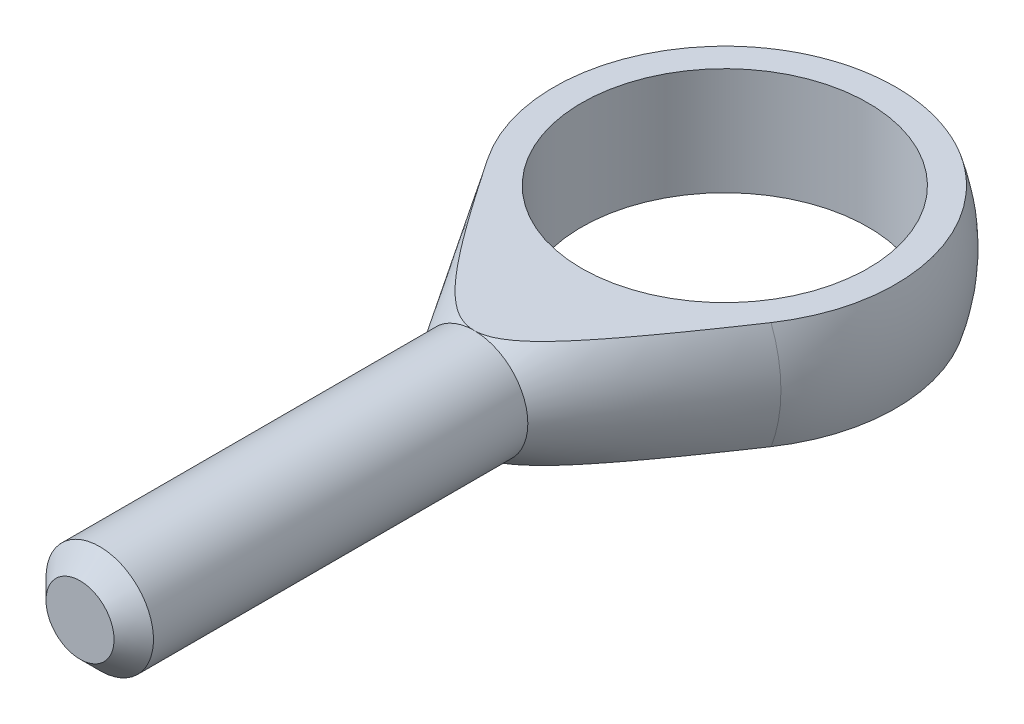
ISO-10303-21;
HEADER;
FILE_DESCRIPTION(('STEP AP214'),'2;1');
FILE_NAME('part.step','',(''),(''),'','','');
FILE_SCHEMA(('AUTOMOTIVE_DESIGN { 1 0 10303 214 1 1 1 1 }'));
ENDSEC;
DATA;
#1=APPLICATION_CONTEXT('core data for automotive mechanical design processes');
#2=APPLICATION_PROTOCOL_DEFINITION('international standard','automotive_design',2000,#1);
#3=PRODUCT_CONTEXT('',#1,'mechanical');
#4=PRODUCT('Part','Part','',(#3));
#5=PRODUCT_RELATED_PRODUCT_CATEGORY('part','',(#4));
#6=PRODUCT_DEFINITION_FORMATION('','',#4);
#7=PRODUCT_DEFINITION_CONTEXT('part definition',#1,'design');
#8=PRODUCT_DEFINITION('design','',#6,#7);
#9=PRODUCT_DEFINITION_SHAPE('','',#8);
#10=(LENGTH_UNIT() NAMED_UNIT(*) SI_UNIT(.MILLI.,.METRE.));
#11=(NAMED_UNIT(*) PLANE_ANGLE_UNIT() SI_UNIT($,.RADIAN.));
#12=(NAMED_UNIT(*) SI_UNIT($,.STERADIAN.) SOLID_ANGLE_UNIT());
#13=UNCERTAINTY_MEASURE_WITH_UNIT(LENGTH_MEASURE(1.E-05),#10,'distance_accuracy_value','');
#14=(GEOMETRIC_REPRESENTATION_CONTEXT(3) GLOBAL_UNCERTAINTY_ASSIGNED_CONTEXT((#13)) GLOBAL_UNIT_ASSIGNED_CONTEXT((#10,
#11,#12)) REPRESENTATION_CONTEXT('',''));
#15=CARTESIAN_POINT('',(0.,0.,0.));
#16=DIRECTION('',(0.,0.,1.));
#17=DIRECTION('',(1.,0.,0.));
#18=AXIS2_PLACEMENT_3D('',#15,#16,#17);
#19=CARTESIAN_POINT('',(0.,0.,14.));
#20=DIRECTION('',(0.,0.,-1.));
#21=DIRECTION('',(-1.,0.,0.));
#22=AXIS2_PLACEMENT_3D('',#19,#20,#21);
#23=CONICAL_SURFACE('',#22,3.,0.562108498785875);
#24=CARTESIAN_POINT('',(0.,0.,5.3297145220547));
#25=DIRECTION('',(0.,0.,-1.));
#26=DIRECTION('',(-1.,0.,0.));
#27=AXIS2_PLACEMENT_3D('',#24,#25,#26);
#28=CIRCLE('',#27,8.46133223041144);
#29=CARTESIAN_POINT('',(-7.91164604323268,-3.,5.3297145220547));
#30=VERTEX_POINT('',#29);
#31=CARTESIAN_POINT('',(-7.91164604323268,3.,5.3297145220547));
#32=VERTEX_POINT('',#31);
#33=EDGE_CURVE('E96',#30,#32,#28,.T.);
#34=ORIENTED_EDGE('',*,*,#33,.F.);
#35=CARTESIAN_POINT('',(-20.2171304294422,-3.,-13.6849647693345));
#36=CARTESIAN_POINT('',(-19.6475915534933,-3.,-12.7906087557486));
#37=CARTESIAN_POINT('',(-19.0777159185057,-3.,-11.8964667916067));
#38=CARTESIAN_POINT('',(-17.9369834615606,-3.,-10.1087790401228));
#39=CARTESIAN_POINT('',(-17.3661266165258,-3.,-9.21523326750839));
#40=CARTESIAN_POINT('',(-16.2222537345725,-3.,-7.42754604847419));
#41=CARTESIAN_POINT('',(-15.6492357146742,-3.,-6.53340587027385));
#42=CARTESIAN_POINT('',(-14.5014615829396,-3.,-4.74626909144887));
#43=CARTESIAN_POINT('',(-13.9267055092038,-3.,-3.8532724663582));
#44=CARTESIAN_POINT('',(-12.7204690368078,-3.,-1.98484172598026));
#45=CARTESIAN_POINT('',(-12.0887446392816,-3.,-1.00956488831262));
#46=CARTESIAN_POINT('',(-11.1376358183454,-3.,0.451106662074508));
#47=CARTESIAN_POINT('',(-10.8200011901681,-3.,0.937640427343386));
#48=CARTESIAN_POINT('',(-10.1832126216309,-3.,1.9097105142141));
#49=CARTESIAN_POINT('',(-9.86405868726731,-3.,2.39524683974177));
#50=CARTESIAN_POINT('',(-9.22415603502309,-3.,3.36439240746115));
#51=CARTESIAN_POINT('',(-8.90340982690725,-3.,3.8480033050738));
#52=CARTESIAN_POINT('',(-8.25921450916733,-3.,4.81341934304479));
#53=CARTESIAN_POINT('',(-7.93576541355032,-3.,5.29522449274228));
#54=CARTESIAN_POINT('',(-7.28512163357539,-3.,6.25622580159708));
#55=CARTESIAN_POINT('',(-6.95792738931369,-3.,6.73542225773473));
#56=CARTESIAN_POINT('',(-6.46294250437189,-3.,7.4513081036142));
#57=CARTESIAN_POINT('',(-6.29725107135995,-3.,7.68944845875477));
#58=CARTESIAN_POINT('',(-5.96411832258301,-3.,8.16450119895415));
#59=CARTESIAN_POINT('',(-5.79667702055703,-3.,8.40141359363241));
#60=CARTESIAN_POINT('',(-5.48730209747777,-3.,8.83483840216752));
#61=CARTESIAN_POINT('',(-5.34570143550075,-3.,9.03158828178302));
#62=CARTESIAN_POINT('',(-5.06059103427076,-3.,9.4237151099798));
#63=CARTESIAN_POINT('',(-4.91708121338148,-3.,9.61909199930206));
#64=CARTESIAN_POINT('',(-4.62738709094182,-3.,10.0084634627567));
#65=CARTESIAN_POINT('',(-4.481198015097,-3.,10.2024544913976));
#66=CARTESIAN_POINT('',(-4.18577343698147,-3.,10.588078703146));
#67=CARTESIAN_POINT('',(-4.0365382565658,-3.,10.779712131966));
#68=CARTESIAN_POINT('',(-3.73618187666401,-3.,11.1571359903158));
#69=CARTESIAN_POINT('',(-3.58511642904324,-3.,11.3429706693042));
#70=CARTESIAN_POINT('',(-3.27770913235875,-3.,11.7104076933266));
#71=CARTESIAN_POINT('',(-3.12136496651513,-3.,11.8920081192873));
#72=CARTESIAN_POINT('',(-2.88168244023602,-3.,12.1593061448795));
#73=CARTESIAN_POINT('',(-2.80104998981976,-3.,12.2474287594133));
#74=CARTESIAN_POINT('',(-2.63764291230634,-3.,12.4216605446309));
#75=CARTESIAN_POINT('',(-2.55486844781459,-3.,12.5077698672094));
#76=CARTESIAN_POINT('',(-2.38681716525777,-3.,12.6773817860513));
#77=CARTESIAN_POINT('',(-2.30154242807809,-3.,12.7608864369585));
#78=CARTESIAN_POINT('',(-2.12790800676365,-3.,12.9246107225168));
#79=CARTESIAN_POINT('',(-2.03954902904578,-3.,13.0048311003723));
#80=CARTESIAN_POINT('',(-1.88765654581182,-3.,13.1362134874475));
#81=CARTESIAN_POINT('',(-1.82512446472287,-3.,13.1885313282308));
#82=CARTESIAN_POINT('',(-1.69804082965637,-3.,13.2906920034734));
#83=CARTESIAN_POINT('',(-1.63348887302669,-3.,13.3405343392633));
#84=CARTESIAN_POINT('',(-1.5020719040929,-3.,13.4371672146784));
#85=CARTESIAN_POINT('',(-1.43520578024621,-3.,13.4839562557148));
#86=CARTESIAN_POINT('',(-1.29893764652659,-3.,13.5736605235933));
#87=CARTESIAN_POINT('',(-1.22953594205866,-3.,13.616576214825));
#88=CARTESIAN_POINT('',(-1.0374058986315,-3.,13.7264918173385));
#89=CARTESIAN_POINT('',(-0.911923435139036,-3.,13.7888580824104));
#90=CARTESIAN_POINT('',(-0.652569252282542,-3.,13.8926488695352));
#91=CARTESIAN_POINT('',(-0.51872185286376,-3.,13.9341311911791));
#92=CARTESIAN_POINT('',(-0.27410449843615,-3.,13.9831776824252));
#93=CARTESIAN_POINT('',(-0.164427117321918,-3.,13.9960531689909));
#94=CARTESIAN_POINT('',(0.0554750395130171,-3.,14.0023765120106));
#95=CARTESIAN_POINT('',(0.165699555115708,-3.,13.9958328547207));
#96=CARTESIAN_POINT('',(0.382890942808701,-3.,13.9644346751235));
#97=CARTESIAN_POINT('',(0.489870108704803,-3.,13.9396616045514));
#98=CARTESIAN_POINT('',(0.699156940225977,-3.,13.8750984809449));
#99=CARTESIAN_POINT('',(0.801459753873671,-3.,13.8352932106073));
#100=CARTESIAN_POINT('',(0.997133685850247,-3.,13.7459372841826));
#101=CARTESIAN_POINT('',(1.09069392243693,-3.,13.6967903610247));
#102=CARTESIAN_POINT('',(1.27324401661325,-3.,13.5905596949449));
#103=CARTESIAN_POINT('',(1.36222928934223,-3.,13.5334681946975));
#104=CARTESIAN_POINT('',(1.53648460828573,-3.,13.4131375449664));
#105=CARTESIAN_POINT('',(1.62173610416318,-3.,13.3498718499137));
#106=CARTESIAN_POINT('',(1.78866713637836,-3.,13.218910454654));
#107=CARTESIAN_POINT('',(1.87034840444904,-3.,13.15121694284));
#108=CARTESIAN_POINT('',(2.03342908331479,-3.,13.0100905929053));
#109=CARTESIAN_POINT('',(2.1147272253995,-3.,12.9365414230549));
#110=CARTESIAN_POINT('',(2.27467381338646,-3.,12.7866077566038));
#111=CARTESIAN_POINT('',(2.35332183984902,-3.,12.7102228151629));
#112=CARTESIAN_POINT('',(2.58604500256424,-3.,12.4776492631874));
#113=CARTESIAN_POINT('',(2.73679339887211,-3.,12.3181362511434));
#114=CARTESIAN_POINT('',(3.03226896562764,-3.,11.9929923297713));
#115=CARTESIAN_POINT('',(3.17698040725352,-3.,11.8273473323046));
#116=CARTESIAN_POINT('',(3.46167778843573,-3.,11.492025127593));
#117=CARTESIAN_POINT('',(3.60166314813547,-3.,11.322347429885));
#118=CARTESIAN_POINT('',(3.87863451872381,-3.,10.9793476268623));
#119=CARTESIAN_POINT('',(4.0156047384573,-3.,10.806012830322));
#120=CARTESIAN_POINT('',(4.28673368039748,-3.,10.4571404857032));
#121=CARTESIAN_POINT('',(4.42089216667964,-3.,10.2816027547429));
#122=CARTESIAN_POINT('',(4.68674394428583,-3.,9.92914766053826));
#123=CARTESIAN_POINT('',(4.81844108135584,-3.,9.75223319205258));
#124=CARTESIAN_POINT('',(5.08003015641668,-3.,9.39708617511469));
#125=CARTESIAN_POINT('',(5.20992215599606,-3.,9.21885367195129));
#126=CARTESIAN_POINT('',(5.59382781634255,-3.,8.68752594845381));
#127=CARTESIAN_POINT('',(5.84573011952478,-3.,8.33290581881572));
#128=CARTESIAN_POINT('',(6.34558338402647,-3.,7.62088810928589));
#129=CARTESIAN_POINT('',(6.59353423142495,-3.,7.26349044975792));
#130=CARTESIAN_POINT('',(7.08656737923312,-3.,6.54667526182682));
#131=CARTESIAN_POINT('',(7.33164941078273,-3.,6.18725754870679));
#132=CARTESIAN_POINT('',(7.81964273167229,-3.,5.4669503327949));
#133=CARTESIAN_POINT('',(8.06255400765211,-3.,5.10606082096459));
#134=CARTESIAN_POINT('',(8.54691064420103,-3.,4.38284898738943));
#135=CARTESIAN_POINT('',(8.78835455868011,-3.,4.02052569786933));
#136=CARTESIAN_POINT('',(9.26991886628617,-3.,3.29500029788505));
#137=CARTESIAN_POINT('',(9.51003925700488,-3.,2.93179818582352));
#138=CARTESIAN_POINT('',(10.2287969483042,-3.,1.84119388427377));
#139=CARTESIAN_POINT('',(10.7058579222837,-3.,1.11275304095377));
#140=CARTESIAN_POINT('',(11.6552140223196,-3.,-0.34295729298507));
#141=CARTESIAN_POINT('',(12.1275206805284,-3.,-1.07021927535936));
#142=CARTESIAN_POINT('',(13.0701624065608,-3.,-2.52603340923671));
#143=CARTESIAN_POINT('',(13.5404974474754,-3.,-3.25458557815678));
#144=CARTESIAN_POINT('',(14.4795873154531,-3.,-4.7124182096334));
#145=CARTESIAN_POINT('',(14.9483425484989,-3.,-5.44169841080659));
#146=CARTESIAN_POINT('',(15.8847595996979,-3.,-6.9009605243471));
#147=CARTESIAN_POINT('',(16.3524214176124,-3.,-7.63094243686752));
#148=CARTESIAN_POINT('',(17.1030769148794,-3.,-8.8041518397528));
#149=CARTESIAN_POINT('',(17.3863383164114,-3.,-9.24720808999418));
#150=CARTESIAN_POINT('',(17.9526051921323,-3.,-10.1335162119202));
#151=CARTESIAN_POINT('',(18.2356106524046,-3.,-10.5767680924964));
#152=CARTESIAN_POINT('',(18.8018279921872,-3.,-11.4641132191838));
#153=CARTESIAN_POINT('',(19.0850395050894,-3.,-11.9082066992074));
#154=CARTESIAN_POINT('',(19.6512406265868,-3.,-12.796502735873));
#155=CARTESIAN_POINT('',(19.9342302459209,-3.,-13.2407052856698));
#156=CARTESIAN_POINT('',(20.2171304294422,-3.,-13.6849647693345));
#157=B_SPLINE_CURVE_WITH_KNOTS('',3,(#35,#36,#37,#38,#39,#40,#41,#42,#43,#44,#45,#46,#47,#48,
#49,#50,#51,#52,#53,#54,#55,#56,#57,#58,#59,#60,#61,#62,#63,#64,#65,#66,#67,#68,#69,#70,#71,#72,
#73,#74,#75,#76,#77,#78,#79,#80,#81,#82,#83,#84,#85,#86,#87,#88,#89,#90,#91,#92,#93,#94,#95,#96,
#97,#98,#99,#100,#101,#102,#103,#104,#105,#106,#107,#108,#109,#110,#111,#112,#113,#114,#115,
#116,#117,#118,#119,#120,#121,#122,#123,#124,#125,#126,#127,#128,#129,#130,#131,#132,#133,#134,
#135,#136,#137,#138,#139,#140,#141,#142,#143,#144,#145,#146,#147,#148,#149,#150,#151,#152,#153,
#154,#155,#156),.UNSPECIFIED.,.F.,.F.,(4,2,2,2,2,2,2,2,2,2,2,2,2,2,2,2,2,2,2,2,2,2,2,2,2,2,2,2,
2,2,2,2,2,2,2,2,2,2,2,2,2,2,2,2,2,2,2,2,2,2,2,2,2,2,2,2,2,2,2,2,4),(0.,3.18091615026535,
6.36190816598838,9.54789567223744,12.7338138365636,16.2197993920076,17.962915701052,
19.7060251361705,21.4469428697494,23.1878515870195,24.9285577867688,25.7988854870591,
26.6692063591402,27.3964192242709,28.1236632858735,28.8523616183058,29.5809833501381,
30.2993926680187,31.0181214958564,31.3764300128476,31.7347114091143,32.0927026422034,
32.4506124118919,32.6951567116034,32.9397500745256,33.184462597264,33.429145741478,
33.8482133636489,34.2661146849673,34.5958026295015,34.9253465200906,35.2534268322314,
35.5818401587736,35.8983964662067,36.2152640664646,36.5335596661691,36.8516991238618,
37.1805050783426,37.5093628315391,38.1675028908296,38.8272623967372,39.4871025584191,
40.1498278956547,40.8126086194403,41.4742485316698,42.1358658140502,43.4407694657472,
44.745710670176,46.0507732075801,47.355843771597,48.6620406753549,49.968239955046,
52.5804917650484,55.1819976751491,57.7835389764282,60.3843510617859,62.9851637147593,
64.5627639477411,66.1404453441603,67.7205876906921,69.3006481513139),.UNSPECIFIED.);
#158=CARTESIAN_POINT('',(0.,-3.,14.));
#159=VERTEX_POINT('',#158);
#160=EDGE_CURVE('E92',#30,#159,#157,.T.);
#161=ORIENTED_EDGE('',*,*,#160,.T.);
#162=CARTESIAN_POINT('',(0.,0.,14.));
#163=DIRECTION('',(0.,0.,-1.));
#164=DIRECTION('',(-1.,0.,0.));
#165=AXIS2_PLACEMENT_3D('',#162,#163,#164);
#166=CIRCLE('',#165,3.);
#167=CARTESIAN_POINT('',(0.,3.,14.));
#168=VERTEX_POINT('',#167);
#169=EDGE_CURVE('E91',#159,#168,#166,.T.);
#170=ORIENTED_EDGE('',*,*,#169,.T.);
#171=CARTESIAN_POINT('',(20.2171304294422,3.,-13.6849647693345));
#172=CARTESIAN_POINT('',(19.6475915534933,3.,-12.7906087557486));
#173=CARTESIAN_POINT('',(19.0777159185057,3.,-11.8964667916067));
#174=CARTESIAN_POINT('',(17.9369834615606,3.,-10.1087790401228));
#175=CARTESIAN_POINT('',(17.3661266165258,3.,-9.2152332675084));
#176=CARTESIAN_POINT('',(16.2222537345725,3.,-7.42754604847419));
#177=CARTESIAN_POINT('',(15.6492357146742,3.,-6.53340587027386));
#178=CARTESIAN_POINT('',(14.5014615829396,3.,-4.74626909144888));
#179=CARTESIAN_POINT('',(13.9267055092038,3.,-3.85327246635821));
#180=CARTESIAN_POINT('',(12.7204690368079,3.,-1.98484172598027));
#181=CARTESIAN_POINT('',(12.0887446392816,3.,-1.00956488831263));
#182=CARTESIAN_POINT('',(11.1376358183454,3.,0.4511066620745));
#183=CARTESIAN_POINT('',(10.8200011901681,3.,0.937640427343377));
#184=CARTESIAN_POINT('',(10.1832126216309,3.,1.9097105142141));
#185=CARTESIAN_POINT('',(9.86405868726731,3.,2.39524683974176));
#186=CARTESIAN_POINT('',(9.2241560350231,3.,3.36439240746115));
#187=CARTESIAN_POINT('',(8.90340982690726,3.,3.8480033050738));
#188=CARTESIAN_POINT('',(8.25921450916733,3.,4.81341934304479));
#189=CARTESIAN_POINT('',(7.93576541355032,3.,5.29522449274228));
#190=CARTESIAN_POINT('',(7.28512163357539,3.,6.25622580159708));
#191=CARTESIAN_POINT('',(6.95792738931369,3.,6.73542225773473));
#192=CARTESIAN_POINT('',(6.46294250437189,3.,7.4513081036142));
#193=CARTESIAN_POINT('',(6.29725107135995,3.,7.68944845875477));
#194=CARTESIAN_POINT('',(5.96411832258301,3.,8.16450119895415));
#195=CARTESIAN_POINT('',(5.79667702055703,3.,8.40141359363241));
#196=CARTESIAN_POINT('',(5.48730209747777,3.,8.83483840216752));
#197=CARTESIAN_POINT('',(5.34570143550075,3.,9.03158828178302));
#198=CARTESIAN_POINT('',(5.06059103427076,3.,9.4237151099798));
#199=CARTESIAN_POINT('',(4.91708121338148,3.,9.61909199930206));
#200=CARTESIAN_POINT('',(4.62738709094182,3.,10.0084634627567));
#201=CARTESIAN_POINT('',(4.481198015097,3.,10.2024544913976));
#202=CARTESIAN_POINT('',(4.18577343698146,3.,10.588078703146));
#203=CARTESIAN_POINT('',(4.0365382565658,3.,10.779712131966));
#204=CARTESIAN_POINT('',(3.73618187666401,3.,11.1571359903158));
#205=CARTESIAN_POINT('',(3.58511642904324,3.,11.3429706693042));
#206=CARTESIAN_POINT('',(3.27770913235874,3.,11.7104076933266));
#207=CARTESIAN_POINT('',(3.12136496651512,3.,11.8920081192873));
#208=CARTESIAN_POINT('',(2.88168244023602,3.,12.1593061448795));
#209=CARTESIAN_POINT('',(2.80104998981976,3.,12.2474287594133));
#210=CARTESIAN_POINT('',(2.63764291230633,3.,12.4216605446309));
#211=CARTESIAN_POINT('',(2.55486844781459,3.,12.5077698672094));
#212=CARTESIAN_POINT('',(2.38681716525777,3.,12.6773817860513));
#213=CARTESIAN_POINT('',(2.30154242807809,3.,12.7608864369585));
#214=CARTESIAN_POINT('',(2.12790800676365,3.,12.9246107225168));
#215=CARTESIAN_POINT('',(2.03954902904578,3.,13.0048311003723));
#216=CARTESIAN_POINT('',(1.88765654581182,3.,13.1362134874475));
#217=CARTESIAN_POINT('',(1.82512446472286,3.,13.1885313282308));
#218=CARTESIAN_POINT('',(1.69804082965636,3.,13.2906920034734));
#219=CARTESIAN_POINT('',(1.63348887302669,3.,13.3405343392633));
#220=CARTESIAN_POINT('',(1.5020719040929,3.,13.4371672146784));
#221=CARTESIAN_POINT('',(1.43520578024621,3.,13.4839562557148));
#222=CARTESIAN_POINT('',(1.29893764652659,3.,13.5736605235933));
#223=CARTESIAN_POINT('',(1.22953594205866,3.,13.616576214825));
#224=CARTESIAN_POINT('',(1.0374058986315,3.,13.7264918173385));
#225=CARTESIAN_POINT('',(0.911923435139035,3.,13.7888580824104));
#226=CARTESIAN_POINT('',(0.652569252282541,3.,13.8926488695352));
#227=CARTESIAN_POINT('',(0.51872185286376,3.,13.9341311911791));
#228=CARTESIAN_POINT('',(0.274104498436149,3.,13.9831776824252));
#229=CARTESIAN_POINT('',(0.164427117321917,3.,13.9960531689909));
#230=CARTESIAN_POINT('',(-0.0554750395130174,3.,14.0023765120106));
#231=CARTESIAN_POINT('',(-0.165699555115708,3.,13.9958328547207));
#232=CARTESIAN_POINT('',(-0.382890942808701,3.,13.9644346751235));
#233=CARTESIAN_POINT('',(-0.489870108704803,3.,13.9396616045514));
#234=CARTESIAN_POINT('',(-0.699156940225977,3.,13.8750984809449));
#235=CARTESIAN_POINT('',(-0.801459753873671,3.,13.8352932106073));
#236=CARTESIAN_POINT('',(-0.99713368585025,3.,13.7459372841826));
#237=CARTESIAN_POINT('',(-1.09069392243694,3.,13.6967903610247));
#238=CARTESIAN_POINT('',(-1.27324401661325,3.,13.5905596949449));
#239=CARTESIAN_POINT('',(-1.36222928934223,3.,13.5334681946975));
#240=CARTESIAN_POINT('',(-1.53648460828573,3.,13.4131375449664));
#241=CARTESIAN_POINT('',(-1.62173610416318,3.,13.3498718499137));
#242=CARTESIAN_POINT('',(-1.78866713637836,3.,13.218910454654));
#243=CARTESIAN_POINT('',(-1.87034840444904,3.,13.15121694284));
#244=CARTESIAN_POINT('',(-2.03342908331479,3.,13.0100905929053));
#245=CARTESIAN_POINT('',(-2.1147272253995,3.,12.9365414230549));
#246=CARTESIAN_POINT('',(-2.27467381338646,3.,12.7866077566038));
#247=CARTESIAN_POINT('',(-2.35332183984902,3.,12.7102228151629));
#248=CARTESIAN_POINT('',(-2.58604500256424,3.,12.4776492631874));
#249=CARTESIAN_POINT('',(-2.73679339887212,3.,12.3181362511434));
#250=CARTESIAN_POINT('',(-3.03226896562765,3.,11.9929923297712));
#251=CARTESIAN_POINT('',(-3.17698040725352,3.,11.8273473323046));
#252=CARTESIAN_POINT('',(-3.46167778843574,3.,11.492025127593));
#253=CARTESIAN_POINT('',(-3.60166314813547,3.,11.322347429885));
#254=CARTESIAN_POINT('',(-3.87863451872382,3.,10.9793476268623));
#255=CARTESIAN_POINT('',(-4.01560473845731,3.,10.806012830322));
#256=CARTESIAN_POINT('',(-4.28673368039749,3.,10.4571404857032));
#257=CARTESIAN_POINT('',(-4.42089216667964,3.,10.2816027547429));
#258=CARTESIAN_POINT('',(-4.68674394428583,3.,9.92914766053825));
#259=CARTESIAN_POINT('',(-4.81844108135585,3.,9.75223319205257));
#260=CARTESIAN_POINT('',(-5.08003015641668,3.,9.39708617511468));
#261=CARTESIAN_POINT('',(-5.20992215599607,3.,9.21885367195128));
#262=CARTESIAN_POINT('',(-5.59382781634256,3.,8.6875259484538));
#263=CARTESIAN_POINT('',(-5.84573011952478,3.,8.33290581881572));
#264=CARTESIAN_POINT('',(-6.34558338402648,3.,7.62088810928589));
#265=CARTESIAN_POINT('',(-6.59353423142496,3.,7.26349044975791));
#266=CARTESIAN_POINT('',(-7.08656737923313,3.,6.54667526182681));
#267=CARTESIAN_POINT('',(-7.33164941078274,3.,6.18725754870677));
#268=CARTESIAN_POINT('',(-7.8196427316723,3.,5.46695033279488));
#269=CARTESIAN_POINT('',(-8.06255400765212,3.,5.10606082096457));
#270=CARTESIAN_POINT('',(-8.54691064420104,3.,4.38284898738941));
#271=CARTESIAN_POINT('',(-8.78835455868013,3.,4.02052569786931));
#272=CARTESIAN_POINT('',(-9.26991886628618,3.,3.29500029788502));
#273=CARTESIAN_POINT('',(-9.5100392570049,3.,2.9317981858235));
#274=CARTESIAN_POINT('',(-10.2287969483042,3.,1.84119388427375));
#275=CARTESIAN_POINT('',(-10.7058579222837,3.,1.11275304095375));
#276=CARTESIAN_POINT('',(-11.6552140223196,3.,-0.342957292985099));
#277=CARTESIAN_POINT('',(-12.1275206805284,3.,-1.07021927535939));
#278=CARTESIAN_POINT('',(-13.0701624065608,3.,-2.52603340923674));
#279=CARTESIAN_POINT('',(-13.5404974474754,3.,-3.25458557815681));
#280=CARTESIAN_POINT('',(-14.4795873154531,3.,-4.71241820963343));
#281=CARTESIAN_POINT('',(-14.9483425484989,3.,-5.44169841080662));
#282=CARTESIAN_POINT('',(-15.8847595996979,3.,-6.90096052434714));
#283=CARTESIAN_POINT('',(-16.3524214176125,3.,-7.63094243686756));
#284=CARTESIAN_POINT('',(-17.1030769148794,3.,-8.80415183975284));
#285=CARTESIAN_POINT('',(-17.3863383164115,3.,-9.24720808999422));
#286=CARTESIAN_POINT('',(-17.9526051921323,3.,-10.1335162119203));
#287=CARTESIAN_POINT('',(-18.2356106524046,3.,-10.5767680924965));
#288=CARTESIAN_POINT('',(-18.8018279921873,3.,-11.4641132191838));
#289=CARTESIAN_POINT('',(-19.0850395050894,3.,-11.9082066992074));
#290=CARTESIAN_POINT('',(-19.6512406265868,3.,-12.796502735873));
#291=CARTESIAN_POINT('',(-19.9342302459209,3.,-13.2407052856698));
#292=CARTESIAN_POINT('',(-20.2171304294422,3.,-13.6849647693345));
#293=B_SPLINE_CURVE_WITH_KNOTS('',3,(#171,#172,#173,#174,#175,#176,#177,#178,#179,#180,#181,
#182,#183,#184,#185,#186,#187,#188,#189,#190,#191,#192,#193,#194,#195,#196,#197,#198,#199,#200,
#201,#202,#203,#204,#205,#206,#207,#208,#209,#210,#211,#212,#213,#214,#215,#216,#217,#218,#219,
#220,#221,#222,#223,#224,#225,#226,#227,#228,#229,#230,#231,#232,#233,#234,#235,#236,#237,#238,
#239,#240,#241,#242,#243,#244,#245,#246,#247,#248,#249,#250,#251,#252,#253,#254,#255,#256,#257,
#258,#259,#260,#261,#262,#263,#264,#265,#266,#267,#268,#269,#270,#271,#272,#273,#274,#275,#276,
#277,#278,#279,#280,#281,#282,#283,#284,#285,#286,#287,#288,#289,#290,#291,#292),.UNSPECIFIED.,
.F.,.F.,(4,2,2,2,2,2,2,2,2,2,2,2,2,2,2,2,2,2,2,2,2,2,2,2,2,2,2,2,2,2,2,2,2,2,2,2,2,2,2,2,2,2,2,
2,2,2,2,2,2,2,2,2,2,2,2,2,2,2,2,2,4),(0.,3.18091615026535,6.36190816598837,9.54789567223743,
12.7338138365636,16.2197993920076,17.962915701052,19.7060251361705,21.4469428697494,
23.1878515870195,24.9285577867688,25.7988854870591,26.6692063591402,27.3964192242709,
28.1236632858735,28.8523616183058,29.5809833501381,30.2993926680187,31.0181214958564,
31.3764300128476,31.7347114091143,32.0927026422034,32.4506124118919,32.6951567116034,
32.9397500745256,33.184462597264,33.429145741478,33.8482133636489,34.2661146849673,
34.5958026295015,34.9253465200906,35.2534268322314,35.5818401587736,35.8983964662067,
36.2152640664646,36.5335596661691,36.8516991238618,37.1805050783425,37.5093628315391,
38.1675028908296,38.8272623967372,39.4871025584191,40.1498278956547,40.8126086194403,
41.4742485316698,42.1358658140502,43.4407694657472,44.745710670176,46.0507732075801,
47.355843771597,48.6620406753549,49.968239955046,52.5804917650484,55.1819976751492,
57.7835389764283,60.3843510617859,62.9851637147593,64.5627639477412,66.1404453441603,
67.7205876906921,69.3006481513139),.UNSPECIFIED.);
#294=EDGE_CURVE('E71',#168,#32,#293,.T.);
#295=ORIENTED_EDGE('',*,*,#294,.T.);
#296=EDGE_LOOP('',(#34,#161,#170,#295));
#297=FACE_BOUND('',#296,.T.);
#298=ADVANCED_FACE('F36',(#297),#23,.T.);
#299=EDGE_CURVE('E86',#168,#159,#166,.T.);
#300=ORIENTED_EDGE('',*,*,#299,.T.);
#301=CARTESIAN_POINT('',(7.91164604323268,-3.,5.3297145220547));
#302=VERTEX_POINT('',#301);
#303=EDGE_CURVE('E88',#159,#302,#157,.T.);
#304=ORIENTED_EDGE('',*,*,#303,.T.);
#305=CARTESIAN_POINT('',(7.91164604323268,3.,5.3297145220547));
#306=VERTEX_POINT('',#305);
#307=EDGE_CURVE('E87',#306,#302,#28,.T.);
#308=ORIENTED_EDGE('',*,*,#307,.F.);
#309=EDGE_CURVE('E74',#306,#168,#293,.T.);
#310=ORIENTED_EDGE('',*,*,#309,.T.);
#311=EDGE_LOOP('',(#300,#304,#308,#310));
#312=FACE_BOUND('',#311,.T.);
#313=ADVANCED_FACE('F84',(#312),#23,.T.);
#314=CARTESIAN_POINT('',(0.,0.,0.));
#315=DIRECTION('',(0.,0.,-1.));
#316=DIRECTION('',(1.,0.,0.));
#317=AXIS2_PLACEMENT_3D('',#314,#315,#316);
#318=SPHERICAL_SURFACE('',#317,10.);
#319=CARTESIAN_POINT('',(0.,-3.,0.));
#320=DIRECTION('',(0.,1.,0.));
#321=DIRECTION('',(0.,0.,1.));
#322=AXIS2_PLACEMENT_3D('',#319,#320,#321);
#323=CIRCLE('',#322,9.53939201416946);
#324=EDGE_CURVE('E52',#302,#30,#323,.T.);
#325=ORIENTED_EDGE('',*,*,#324,.T.);
#326=ORIENTED_EDGE('',*,*,#33,.T.);
#327=CARTESIAN_POINT('',(0.,3.,0.));
#328=DIRECTION('',(0.,-1.,0.));
#329=DIRECTION('',(0.,0.,-1.));
#330=AXIS2_PLACEMENT_3D('',#327,#328,#329);
#331=CIRCLE('',#330,9.53939201416946);
#332=EDGE_CURVE('E76',#32,#306,#331,.T.);
#333=ORIENTED_EDGE('',*,*,#332,.T.);
#334=ORIENTED_EDGE('',*,*,#307,.T.);
#335=EDGE_LOOP('',(#325,#326,#333,#334));
#336=FACE_BOUND('',#335,.T.);
#337=ADVANCED_FACE('F124',(#336),#318,.T.);
#338=CARTESIAN_POINT('',(0.,0.,36.));
#339=DIRECTION('',(0.,0.,-1.));
#340=DIRECTION('',(-1.,0.,0.));
#341=AXIS2_PLACEMENT_3D('',#338,#339,#340);
#342=PLANE('',#341);
#343=CARTESIAN_POINT('',(0.,0.,36.));
#344=DIRECTION('',(0.,0.,-1.));
#345=DIRECTION('',(-1.,0.,0.));
#346=AXIS2_PLACEMENT_3D('',#343,#344,#345);
#347=CIRCLE('',#346,1.90000000000001);
#348=CARTESIAN_POINT('',(-1.90000000000001,0.,36.));
#349=VERTEX_POINT('',#348);
#350=EDGE_CURVE('E11',#349,#349,#347,.F.);
#351=ORIENTED_EDGE('',*,*,#350,.T.);
#352=EDGE_LOOP('',(#351));
#353=FACE_BOUND('',#352,.T.);
#354=ADVANCED_FACE('F142',(#353),#342,.F.);
#355=CARTESIAN_POINT('',(0.,0.,-26.0435164980697));
#356=DIRECTION('',(0.,0.,-1.));
#357=DIRECTION('',(-1.,0.,0.));
#358=AXIS2_PLACEMENT_3D('',#355,#356,#357);
#359=CYLINDRICAL_SURFACE('',#358,3.);
#360=CARTESIAN_POINT('',(0.,0.,34.9));
#361=DIRECTION('',(0.,0.,-1.));
#362=DIRECTION('',(-1.,0.,0.));
#363=AXIS2_PLACEMENT_3D('',#360,#361,#362);
#364=CIRCLE('',#363,3.);
#365=CARTESIAN_POINT('',(-3.,0.,34.9));
#366=VERTEX_POINT('',#365);
#367=EDGE_CURVE('E45',#366,#366,#364,.T.);
#368=ORIENTED_EDGE('',*,*,#367,.T.);
#369=EDGE_LOOP('',(#368));
#370=FACE_BOUND('',#369,.T.);
#371=ORIENTED_EDGE('',*,*,#299,.F.);
#372=ORIENTED_EDGE('',*,*,#169,.F.);
#373=EDGE_LOOP('',(#371,#372));
#374=FACE_BOUND('',#373,.T.);
#375=ADVANCED_FACE('F95',(#370,#374),#359,.T.);
#376=CARTESIAN_POINT('',(-10.,3.,14.));
#377=DIRECTION('',(0.,-1.,0.));
#378=DIRECTION('',(0.,0.,-1.));
#379=AXIS2_PLACEMENT_3D('',#376,#377,#378);
#380=PLANE('',#379);
#381=CARTESIAN_POINT('',(0.,3.00000000000001,0.));
#382=DIRECTION('',(0.,1.,0.));
#383=DIRECTION('',(0.,0.,1.));
#384=AXIS2_PLACEMENT_3D('',#381,#382,#383);
#385=CIRCLE('',#384,8.);
#386=CARTESIAN_POINT('',(0.,3.00000000000001,8.));
#387=VERTEX_POINT('',#386);
#388=EDGE_CURVE('E200',#387,#387,#385,.T.);
#389=ORIENTED_EDGE('',*,*,#388,.F.);
#390=EDGE_LOOP('',(#389));
#391=FACE_BOUND('',#390,.T.);
#392=ORIENTED_EDGE('',*,*,#309,.F.);
#393=ORIENTED_EDGE('',*,*,#332,.F.);
#394=ORIENTED_EDGE('',*,*,#294,.F.);
#395=EDGE_LOOP('',(#392,#393,#394));
#396=FACE_BOUND('',#395,.T.);
#397=ADVANCED_FACE('F73',(#391,#396),#380,.F.);
#398=CARTESIAN_POINT('',(-10.,-3.,14.));
#399=DIRECTION('',(0.,1.,0.));
#400=DIRECTION('',(0.,0.,1.));
#401=AXIS2_PLACEMENT_3D('',#398,#399,#400);
#402=PLANE('',#401);
#403=CARTESIAN_POINT('',(0.,-3.00000000000001,0.));
#404=DIRECTION('',(0.,1.,0.));
#405=DIRECTION('',(0.,0.,1.));
#406=AXIS2_PLACEMENT_3D('',#403,#404,#405);
#407=CIRCLE('',#406,8.);
#408=CARTESIAN_POINT('',(0.,-3.00000000000001,8.));
#409=VERTEX_POINT('',#408);
#410=EDGE_CURVE('E80',#409,#409,#407,.T.);
#411=ORIENTED_EDGE('',*,*,#410,.T.);
#412=EDGE_LOOP('',(#411));
#413=FACE_BOUND('',#412,.T.);
#414=ORIENTED_EDGE('',*,*,#160,.F.);
#415=ORIENTED_EDGE('',*,*,#324,.F.);
#416=ORIENTED_EDGE('',*,*,#303,.F.);
#417=EDGE_LOOP('',(#414,#415,#416));
#418=FACE_BOUND('',#417,.T.);
#419=ADVANCED_FACE('F116',(#413,#418),#402,.F.);
#420=CARTESIAN_POINT('',(0.,-3.00000000000001,0.));
#421=DIRECTION('',(0.,1.,0.));
#422=DIRECTION('',(0.,0.,1.));
#423=AXIS2_PLACEMENT_3D('',#420,#421,#422);
#424=CYLINDRICAL_SURFACE('',#423,8.);
#425=ORIENTED_EDGE('',*,*,#410,.F.);
#426=EDGE_LOOP('',(#425));
#427=FACE_BOUND('',#426,.T.);
#428=ORIENTED_EDGE('',*,*,#388,.T.);
#429=EDGE_LOOP('',(#428));
#430=FACE_BOUND('',#429,.T.);
#431=ADVANCED_FACE('F111',(#427,#430),#424,.F.);
#432=CARTESIAN_POINT('',(0.,0.,34.9));
#433=DIRECTION('',(0.,0.,-1.));
#434=DIRECTION('',(-1.,0.,0.));
#435=AXIS2_PLACEMENT_3D('',#432,#433,#434);
#436=CONICAL_SURFACE('',#435,3.,0.785398163397452);
#437=ORIENTED_EDGE('',*,*,#350,.F.);
#438=EDGE_LOOP('',(#437));
#439=FACE_BOUND('',#438,.T.);
#440=ORIENTED_EDGE('',*,*,#367,.F.);
#441=EDGE_LOOP('',(#440));
#442=FACE_BOUND('',#441,.T.);
#443=ADVANCED_FACE('F39',(#439,#442),#436,.T.);
#444=CLOSED_SHELL('',(#298,#313,#337,#354,#375,#397,#419,#431,#443));
#445=MANIFOLD_SOLID_BREP('B2',#444);
#446=ADVANCED_BREP_SHAPE_REPRESENTATION('',(#18,#445),#14);
#447=SHAPE_DEFINITION_REPRESENTATION(#9,#446);
ENDSEC;
END-ISO-10303-21;
